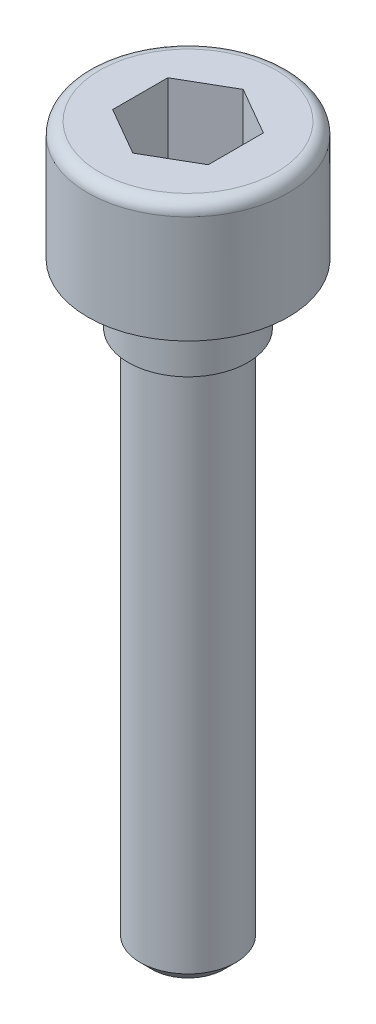
ISO-10303-21;
HEADER;
FILE_DESCRIPTION(('STEP AP214'),'2;1');
FILE_NAME('part.step','',(''),(''),'','','');
FILE_SCHEMA(('AUTOMOTIVE_DESIGN { 1 0 10303 214 1 1 1 1 }'));
ENDSEC;
DATA;
#1=APPLICATION_CONTEXT('core data for automotive mechanical design processes');
#2=APPLICATION_PROTOCOL_DEFINITION('international standard','automotive_design',2000,#1);
#3=PRODUCT_CONTEXT('',#1,'mechanical');
#4=PRODUCT('Part','Part','',(#3));
#5=PRODUCT_RELATED_PRODUCT_CATEGORY('part','',(#4));
#6=PRODUCT_DEFINITION_FORMATION('','',#4);
#7=PRODUCT_DEFINITION_CONTEXT('part definition',#1,'design');
#8=PRODUCT_DEFINITION('design','',#6,#7);
#9=PRODUCT_DEFINITION_SHAPE('','',#8);
#10=(LENGTH_UNIT() NAMED_UNIT(*) SI_UNIT(.MILLI.,.METRE.));
#11=(NAMED_UNIT(*) PLANE_ANGLE_UNIT() SI_UNIT($,.RADIAN.));
#12=(NAMED_UNIT(*) SI_UNIT($,.STERADIAN.) SOLID_ANGLE_UNIT());
#13=UNCERTAINTY_MEASURE_WITH_UNIT(LENGTH_MEASURE(1.E-05),#10,'distance_accuracy_value','');
#14=(GEOMETRIC_REPRESENTATION_CONTEXT(3) GLOBAL_UNCERTAINTY_ASSIGNED_CONTEXT((#13)) GLOBAL_UNIT_ASSIGNED_CONTEXT((#10,
#11,#12)) REPRESENTATION_CONTEXT('',''));
#15=CARTESIAN_POINT('',(0.,0.,0.));
#16=DIRECTION('',(0.,0.,1.));
#17=DIRECTION('',(1.,0.,0.));
#18=AXIS2_PLACEMENT_3D('',#15,#16,#17);
#19=CARTESIAN_POINT('',(0.,0.,0.));
#20=DIRECTION('',(0.,1.,0.));
#21=DIRECTION('',(0.,0.,1.));
#22=AXIS2_PLACEMENT_3D('',#19,#20,#21);
#23=CYLINDRICAL_SURFACE('',#22,2.5);
#24=CARTESIAN_POINT('',(0.,-5.,0.));
#25=DIRECTION('',(0.,1.,0.));
#26=DIRECTION('',(0.,0.,1.));
#27=AXIS2_PLACEMENT_3D('',#24,#25,#26);
#28=CIRCLE('',#27,2.5);
#29=CARTESIAN_POINT('',(0.,-5.,2.5));
#30=VERTEX_POINT('',#29);
#31=EDGE_CURVE('E139',#30,#30,#28,.T.);
#32=ORIENTED_EDGE('',*,*,#31,.F.);
#33=EDGE_LOOP('',(#32));
#34=FACE_BOUND('',#33,.T.);
#35=CARTESIAN_POINT('',(0.,-7.5,0.));
#36=DIRECTION('',(0.,1.,0.));
#37=DIRECTION('',(0.,0.,1.));
#38=AXIS2_PLACEMENT_3D('',#35,#36,#37);
#39=CIRCLE('',#38,2.5);
#40=CARTESIAN_POINT('',(0.,-7.5,2.5));
#41=VERTEX_POINT('',#40);
#42=EDGE_CURVE('E126',#41,#41,#39,.T.);
#43=ORIENTED_EDGE('',*,*,#42,.T.);
#44=EDGE_LOOP('',(#43));
#45=FACE_BOUND('',#44,.T.);
#46=ADVANCED_FACE('F36',(#34,#45),#23,.T.);
#47=CARTESIAN_POINT('',(0.,0.,0.));
#48=DIRECTION('',(0.,-1.,0.));
#49=DIRECTION('',(0.,0.,-1.));
#50=AXIS2_PLACEMENT_3D('',#47,#48,#49);
#51=PLANE('',#50);
#52=CARTESIAN_POINT('',(0.,0.,0.));
#53=DIRECTION('',(0.,-1.,0.));
#54=DIRECTION('',(0.,0.,-1.));
#55=AXIS2_PLACEMENT_3D('',#52,#53,#54);
#56=CIRCLE('',#55,3.7);
#57=CARTESIAN_POINT('',(0.,0.,-3.7));
#58=VERTEX_POINT('',#57);
#59=EDGE_CURVE('E150',#58,#58,#56,.F.);
#60=ORIENTED_EDGE('',*,*,#59,.T.);
#61=EDGE_LOOP('',(#60));
#62=FACE_BOUND('',#61,.T.);
#63=DIRECTION('',(-0.866025403784438,0.,-0.5));
#64=VECTOR('',#63,1.);
#65=CARTESIAN_POINT('',(2.,0.,-1.15470053837925));
#66=LINE('',#65,#64);
#67=CARTESIAN_POINT('',(2.,0.,-1.15470053837925));
#68=VERTEX_POINT('',#67);
#69=CARTESIAN_POINT('',(0.,0.,-2.3094010767585));
#70=VERTEX_POINT('',#69);
#71=EDGE_CURVE('E125',#68,#70,#66,.T.);
#72=ORIENTED_EDGE('',*,*,#71,.F.);
#73=DIRECTION('',(0.,0.,-1.));
#74=VECTOR('',#73,1.);
#75=CARTESIAN_POINT('',(2.,0.,1.15470053837925));
#76=LINE('',#75,#74);
#77=CARTESIAN_POINT('',(2.,0.,1.15470053837925));
#78=VERTEX_POINT('',#77);
#79=EDGE_CURVE('E51',#78,#68,#76,.T.);
#80=ORIENTED_EDGE('',*,*,#79,.F.);
#81=DIRECTION('',(0.866025403784438,0.,-0.5));
#82=VECTOR('',#81,1.);
#83=CARTESIAN_POINT('',(0.,0.,2.3094010767585));
#84=LINE('',#83,#82);
#85=CARTESIAN_POINT('',(0.,0.,2.3094010767585));
#86=VERTEX_POINT('',#85);
#87=EDGE_CURVE('E135',#86,#78,#84,.T.);
#88=ORIENTED_EDGE('',*,*,#87,.F.);
#89=DIRECTION('',(0.866025403784438,0.,0.5));
#90=VECTOR('',#89,1.);
#91=CARTESIAN_POINT('',(-2.,0.,1.15470053837925));
#92=LINE('',#91,#90);
#93=CARTESIAN_POINT('',(-2.,0.,1.15470053837925));
#94=VERTEX_POINT('',#93);
#95=EDGE_CURVE('E133',#94,#86,#92,.T.);
#96=ORIENTED_EDGE('',*,*,#95,.F.);
#97=DIRECTION('',(0.,0.,1.));
#98=VECTOR('',#97,1.);
#99=CARTESIAN_POINT('',(-2.,0.,-1.15470053837925));
#100=LINE('',#99,#98);
#101=CARTESIAN_POINT('',(-2.,0.,-1.15470053837925));
#102=VERTEX_POINT('',#101);
#103=EDGE_CURVE('E99',#102,#94,#100,.T.);
#104=ORIENTED_EDGE('',*,*,#103,.F.);
#105=DIRECTION('',(-0.866025403784439,0.,0.5));
#106=VECTOR('',#105,1.);
#107=CARTESIAN_POINT('',(0.,0.,-2.3094010767585));
#108=LINE('',#107,#106);
#109=EDGE_CURVE('E129',#70,#102,#108,.T.);
#110=ORIENTED_EDGE('',*,*,#109,.F.);
#111=EDGE_LOOP('',(#72,#80,#88,#96,#104,#110));
#112=FACE_BOUND('',#111,.T.);
#113=ADVANCED_FACE('F172',(#62,#112),#51,.F.);
#114=CARTESIAN_POINT('',(0.,0.,0.));
#115=DIRECTION('',(0.,1.,0.));
#116=DIRECTION('',(0.,0.,1.));
#117=AXIS2_PLACEMENT_3D('',#114,#115,#116);
#118=CYLINDRICAL_SURFACE('',#117,4.2);
#119=CARTESIAN_POINT('',(0.,-0.5,0.));
#120=DIRECTION('',(0.,-1.,0.));
#121=DIRECTION('',(0.,0.,-1.));
#122=AXIS2_PLACEMENT_3D('',#119,#120,#121);
#123=CIRCLE('',#122,4.2);
#124=CARTESIAN_POINT('',(0.,-0.5,-4.2));
#125=VERTEX_POINT('',#124);
#126=EDGE_CURVE('E153',#125,#125,#123,.T.);
#127=ORIENTED_EDGE('',*,*,#126,.T.);
#128=EDGE_LOOP('',(#127));
#129=FACE_BOUND('',#128,.T.);
#130=CARTESIAN_POINT('',(0.,-5.,0.));
#131=DIRECTION('',(0.,1.,0.));
#132=DIRECTION('',(0.,0.,1.));
#133=AXIS2_PLACEMENT_3D('',#130,#131,#132);
#134=CIRCLE('',#133,4.2);
#135=CARTESIAN_POINT('',(0.,-5.,4.2));
#136=VERTEX_POINT('',#135);
#137=EDGE_CURVE('E147',#136,#136,#134,.T.);
#138=ORIENTED_EDGE('',*,*,#137,.T.);
#139=EDGE_LOOP('',(#138));
#140=FACE_BOUND('',#139,.T.);
#141=ADVANCED_FACE('F178',(#129,#140),#118,.T.);
#142=CARTESIAN_POINT('',(4.2,-5.,0.));
#143=DIRECTION('',(0.,1.,0.));
#144=DIRECTION('',(0.,0.,1.));
#145=AXIS2_PLACEMENT_3D('',#142,#143,#144);
#146=PLANE('',#145);
#147=ORIENTED_EDGE('',*,*,#137,.F.);
#148=EDGE_LOOP('',(#147));
#149=FACE_BOUND('',#148,.T.);
#150=ORIENTED_EDGE('',*,*,#31,.T.);
#151=EDGE_LOOP('',(#150));
#152=FACE_BOUND('',#151,.T.);
#153=ADVANCED_FACE('F185',(#149,#152),#146,.F.);
#154=CARTESIAN_POINT('',(2.,-3.,1.15470053837925));
#155=DIRECTION('',(1.,0.,0.));
#156=DIRECTION('',(0.,0.,-1.));
#157=AXIS2_PLACEMENT_3D('',#154,#155,#156);
#158=PLANE('',#157);
#159=ORIENTED_EDGE('',*,*,#79,.T.);
#160=DIRECTION('',(0.,1.,0.));
#161=VECTOR('',#160,1.);
#162=CARTESIAN_POINT('',(2.,-3.,-1.15470053837925));
#163=LINE('',#162,#161);
#164=CARTESIAN_POINT('',(2.,-3.,-1.15470053837925));
#165=VERTEX_POINT('',#164);
#166=EDGE_CURVE('E81',#165,#68,#163,.T.);
#167=ORIENTED_EDGE('',*,*,#166,.F.);
#168=DIRECTION('',(0.,0.,-1.));
#169=VECTOR('',#168,1.);
#170=CARTESIAN_POINT('',(2.,-3.,1.15470053837925));
#171=LINE('',#170,#169);
#172=CARTESIAN_POINT('',(2.,-3.,1.15470053837925));
#173=VERTEX_POINT('',#172);
#174=EDGE_CURVE('E137',#173,#165,#171,.T.);
#175=ORIENTED_EDGE('',*,*,#174,.F.);
#176=DIRECTION('',(0.,1.,0.));
#177=VECTOR('',#176,1.);
#178=CARTESIAN_POINT('',(2.,-3.,1.15470053837925));
#179=LINE('',#178,#177);
#180=EDGE_CURVE('E59',#173,#78,#179,.T.);
#181=ORIENTED_EDGE('',*,*,#180,.T.);
#182=EDGE_LOOP('',(#159,#167,#175,#181));
#183=FACE_BOUND('',#182,.T.);
#184=ADVANCED_FACE('F188',(#183),#158,.F.);
#185=CARTESIAN_POINT('',(0.,-3.,2.3094010767585));
#186=DIRECTION('',(0.5,0.,0.866025403784439));
#187=DIRECTION('',(0.866025403784439,0.,-0.5));
#188=AXIS2_PLACEMENT_3D('',#185,#186,#187);
#189=PLANE('',#188);
#190=ORIENTED_EDGE('',*,*,#87,.T.);
#191=ORIENTED_EDGE('',*,*,#180,.F.);
#192=DIRECTION('',(0.866025403784438,0.,-0.5));
#193=VECTOR('',#192,1.);
#194=CARTESIAN_POINT('',(0.,-3.,2.3094010767585));
#195=LINE('',#194,#193);
#196=CARTESIAN_POINT('',(0.,-3.,2.3094010767585));
#197=VERTEX_POINT('',#196);
#198=EDGE_CURVE('E111',#197,#173,#195,.T.);
#199=ORIENTED_EDGE('',*,*,#198,.F.);
#200=DIRECTION('',(0.,1.,0.));
#201=VECTOR('',#200,1.);
#202=CARTESIAN_POINT('',(0.,-3.,2.3094010767585));
#203=LINE('',#202,#201);
#204=EDGE_CURVE('E103',#197,#86,#203,.T.);
#205=ORIENTED_EDGE('',*,*,#204,.T.);
#206=EDGE_LOOP('',(#190,#191,#199,#205));
#207=FACE_BOUND('',#206,.T.);
#208=ADVANCED_FACE('F225',(#207),#189,.F.);
#209=CARTESIAN_POINT('',(-2.,-3.,1.15470053837925));
#210=DIRECTION('',(-0.5,0.,0.866025403784439));
#211=DIRECTION('',(0.866025403784439,0.,0.5));
#212=AXIS2_PLACEMENT_3D('',#209,#210,#211);
#213=PLANE('',#212);
#214=ORIENTED_EDGE('',*,*,#95,.T.);
#215=ORIENTED_EDGE('',*,*,#204,.F.);
#216=DIRECTION('',(0.866025403784438,0.,0.5));
#217=VECTOR('',#216,1.);
#218=CARTESIAN_POINT('',(-2.,-3.,1.15470053837925));
#219=LINE('',#218,#217);
#220=CARTESIAN_POINT('',(-2.,-3.,1.15470053837925));
#221=VERTEX_POINT('',#220);
#222=EDGE_CURVE('E107',#221,#197,#219,.T.);
#223=ORIENTED_EDGE('',*,*,#222,.F.);
#224=DIRECTION('',(0.,1.,0.));
#225=VECTOR('',#224,1.);
#226=CARTESIAN_POINT('',(-2.,-3.,1.15470053837925));
#227=LINE('',#226,#225);
#228=EDGE_CURVE('E92',#221,#94,#227,.T.);
#229=ORIENTED_EDGE('',*,*,#228,.T.);
#230=EDGE_LOOP('',(#214,#215,#223,#229));
#231=FACE_BOUND('',#230,.T.);
#232=ADVANCED_FACE('F108',(#231),#213,.F.);
#233=CARTESIAN_POINT('',(-2.,-3.,-1.15470053837925));
#234=DIRECTION('',(-1.,0.,0.));
#235=DIRECTION('',(0.,0.,1.));
#236=AXIS2_PLACEMENT_3D('',#233,#234,#235);
#237=PLANE('',#236);
#238=ORIENTED_EDGE('',*,*,#103,.T.);
#239=ORIENTED_EDGE('',*,*,#228,.F.);
#240=DIRECTION('',(0.,0.,1.));
#241=VECTOR('',#240,1.);
#242=CARTESIAN_POINT('',(-2.,-3.,-1.15470053837925));
#243=LINE('',#242,#241);
#244=CARTESIAN_POINT('',(-2.,-3.,-1.15470053837925));
#245=VERTEX_POINT('',#244);
#246=EDGE_CURVE('E96',#245,#221,#243,.T.);
#247=ORIENTED_EDGE('',*,*,#246,.F.);
#248=DIRECTION('',(0.,1.,0.));
#249=VECTOR('',#248,1.);
#250=CARTESIAN_POINT('',(-2.,-3.,-1.15470053837925));
#251=LINE('',#250,#249);
#252=EDGE_CURVE('E104',#245,#102,#251,.T.);
#253=ORIENTED_EDGE('',*,*,#252,.T.);
#254=EDGE_LOOP('',(#238,#239,#247,#253));
#255=FACE_BOUND('',#254,.T.);
#256=ADVANCED_FACE('F94',(#255),#237,.F.);
#257=CARTESIAN_POINT('',(0.,-3.,-2.3094010767585));
#258=DIRECTION('',(-0.5,0.,-0.866025403784439));
#259=DIRECTION('',(-0.866025403784439,0.,0.5));
#260=AXIS2_PLACEMENT_3D('',#257,#258,#259);
#261=PLANE('',#260);
#262=ORIENTED_EDGE('',*,*,#109,.T.);
#263=ORIENTED_EDGE('',*,*,#252,.F.);
#264=DIRECTION('',(-0.866025403784439,0.,0.5));
#265=VECTOR('',#264,1.);
#266=CARTESIAN_POINT('',(0.,-3.,-2.3094010767585));
#267=LINE('',#266,#265);
#268=CARTESIAN_POINT('',(0.,-3.,-2.3094010767585));
#269=VERTEX_POINT('',#268);
#270=EDGE_CURVE('E117',#269,#245,#267,.T.);
#271=ORIENTED_EDGE('',*,*,#270,.F.);
#272=DIRECTION('',(0.,1.,0.));
#273=VECTOR('',#272,1.);
#274=CARTESIAN_POINT('',(0.,-3.,-2.3094010767585));
#275=LINE('',#274,#273);
#276=EDGE_CURVE('E142',#269,#70,#275,.T.);
#277=ORIENTED_EDGE('',*,*,#276,.T.);
#278=EDGE_LOOP('',(#262,#263,#271,#277));
#279=FACE_BOUND('',#278,.T.);
#280=ADVANCED_FACE('F232',(#279),#261,.F.);
#281=CARTESIAN_POINT('',(2.,-3.,-1.15470053837925));
#282=DIRECTION('',(0.5,0.,-0.866025403784439));
#283=DIRECTION('',(-0.866025403784439,0.,-0.5));
#284=AXIS2_PLACEMENT_3D('',#281,#282,#283);
#285=PLANE('',#284);
#286=ORIENTED_EDGE('',*,*,#71,.T.);
#287=ORIENTED_EDGE('',*,*,#276,.F.);
#288=DIRECTION('',(-0.866025403784438,0.,-0.5));
#289=VECTOR('',#288,1.);
#290=CARTESIAN_POINT('',(2.,-3.,-1.15470053837925));
#291=LINE('',#290,#289);
#292=EDGE_CURVE('E119',#165,#269,#291,.T.);
#293=ORIENTED_EDGE('',*,*,#292,.F.);
#294=ORIENTED_EDGE('',*,*,#166,.T.);
#295=EDGE_LOOP('',(#286,#287,#293,#294));
#296=FACE_BOUND('',#295,.T.);
#297=ADVANCED_FACE('F200',(#296),#285,.F.);
#298=CARTESIAN_POINT('',(2.,-3.,-1.15470053837925));
#299=DIRECTION('',(0.,1.,0.));
#300=DIRECTION('',(0.,0.,1.));
#301=AXIS2_PLACEMENT_3D('',#298,#299,#300);
#302=PLANE('',#301);
#303=ORIENTED_EDGE('',*,*,#174,.T.);
#304=ORIENTED_EDGE('',*,*,#292,.T.);
#305=ORIENTED_EDGE('',*,*,#270,.T.);
#306=ORIENTED_EDGE('',*,*,#246,.T.);
#307=ORIENTED_EDGE('',*,*,#222,.T.);
#308=ORIENTED_EDGE('',*,*,#198,.T.);
#309=EDGE_LOOP('',(#303,#304,#305,#306,#307,#308));
#310=FACE_BOUND('',#309,.T.);
#311=ADVANCED_FACE('F114',(#310),#302,.T.);
#312=CARTESIAN_POINT('',(0.,-0.5,0.));
#313=DIRECTION('',(0.,-1.,0.));
#314=DIRECTION('',(0.,0.,-1.));
#315=AXIS2_PLACEMENT_3D('',#312,#313,#314);
#316=TOROIDAL_SURFACE('',#315,3.7,0.5);
#317=ORIENTED_EDGE('',*,*,#126,.F.);
#318=EDGE_LOOP('',(#317));
#319=FACE_BOUND('',#318,.T.);
#320=ORIENTED_EDGE('',*,*,#59,.F.);
#321=EDGE_LOOP('',(#320));
#322=FACE_BOUND('',#321,.T.);
#323=ADVANCED_FACE('F192',(#319,#322),#316,.T.);
#324=CARTESIAN_POINT('',(0.,0.,0.));
#325=DIRECTION('',(0.,1.,0.));
#326=DIRECTION('',(0.,0.,1.));
#327=AXIS2_PLACEMENT_3D('',#324,#325,#326);
#328=CYLINDRICAL_SURFACE('',#327,2.);
#329=CARTESIAN_POINT('',(0.,-29.5,0.));
#330=DIRECTION('',(0.,1.,0.));
#331=DIRECTION('',(0.,0.,1.));
#332=AXIS2_PLACEMENT_3D('',#329,#330,#331);
#333=CIRCLE('',#332,2.);
#334=CARTESIAN_POINT('',(0.,-29.5,2.));
#335=VERTEX_POINT('',#334);
#336=EDGE_CURVE('E44',#335,#335,#333,.T.);
#337=ORIENTED_EDGE('',*,*,#336,.T.);
#338=EDGE_LOOP('',(#337));
#339=FACE_BOUND('',#338,.T.);
#340=CARTESIAN_POINT('',(0.,-7.5,0.));
#341=DIRECTION('',(0.,1.,0.));
#342=DIRECTION('',(0.,0.,1.));
#343=AXIS2_PLACEMENT_3D('',#340,#341,#342);
#344=CIRCLE('',#343,2.);
#345=CARTESIAN_POINT('',(0.,-7.5,2.));
#346=VERTEX_POINT('',#345);
#347=EDGE_CURVE('E214',#346,#346,#344,.T.);
#348=ORIENTED_EDGE('',*,*,#347,.F.);
#349=EDGE_LOOP('',(#348));
#350=FACE_BOUND('',#349,.T.);
#351=ADVANCED_FACE('F158',(#339,#350),#328,.T.);
#352=CARTESIAN_POINT('',(2.,-7.5,0.));
#353=DIRECTION('',(0.,-1.,0.));
#354=DIRECTION('',(0.,0.,-1.));
#355=AXIS2_PLACEMENT_3D('',#352,#353,#354);
#356=PLANE('',#355);
#357=ORIENTED_EDGE('',*,*,#347,.T.);
#358=EDGE_LOOP('',(#357));
#359=FACE_BOUND('',#358,.T.);
#360=ORIENTED_EDGE('',*,*,#42,.F.);
#361=EDGE_LOOP('',(#360));
#362=FACE_BOUND('',#361,.T.);
#363=ADVANCED_FACE('F167',(#359,#362),#356,.T.);
#364=CARTESIAN_POINT('',(2.5,-30.,0.));
#365=DIRECTION('',(0.,1.,0.));
#366=DIRECTION('',(0.,0.,1.));
#367=AXIS2_PLACEMENT_3D('',#364,#365,#366);
#368=PLANE('',#367);
#369=CARTESIAN_POINT('',(0.,-30.,0.));
#370=DIRECTION('',(0.,1.,0.));
#371=DIRECTION('',(0.,0.,1.));
#372=AXIS2_PLACEMENT_3D('',#369,#370,#371);
#373=CIRCLE('',#372,1.5);
#374=CARTESIAN_POINT('',(0.,-30.,1.5));
#375=VERTEX_POINT('',#374);
#376=EDGE_CURVE('E11',#375,#375,#373,.F.);
#377=ORIENTED_EDGE('',*,*,#376,.T.);
#378=EDGE_LOOP('',(#377));
#379=FACE_BOUND('',#378,.T.);
#380=ADVANCED_FACE('F162',(#379),#368,.F.);
#381=CARTESIAN_POINT('',(0.,-29.5,0.));
#382=DIRECTION('',(0.,1.,0.));
#383=DIRECTION('',(0.,0.,1.));
#384=AXIS2_PLACEMENT_3D('',#381,#382,#383);
#385=CONICAL_SURFACE('',#384,2.,0.785398163397449);
#386=ORIENTED_EDGE('',*,*,#376,.F.);
#387=EDGE_LOOP('',(#386));
#388=FACE_BOUND('',#387,.T.);
#389=ORIENTED_EDGE('',*,*,#336,.F.);
#390=EDGE_LOOP('',(#389));
#391=FACE_BOUND('',#390,.T.);
#392=ADVANCED_FACE('F38',(#388,#391),#385,.T.);
#393=CLOSED_SHELL('',(#46,#113,#141,#153,#184,#208,#232,#256,#280,#297,#311,#323,#351,#363,#380,#392));
#394=MANIFOLD_SOLID_BREP('B2',#393);
#395=ADVANCED_BREP_SHAPE_REPRESENTATION('',(#18,#394),#14);
#396=SHAPE_DEFINITION_REPRESENTATION(#9,#395);
ENDSEC;
END-ISO-10303-21;
